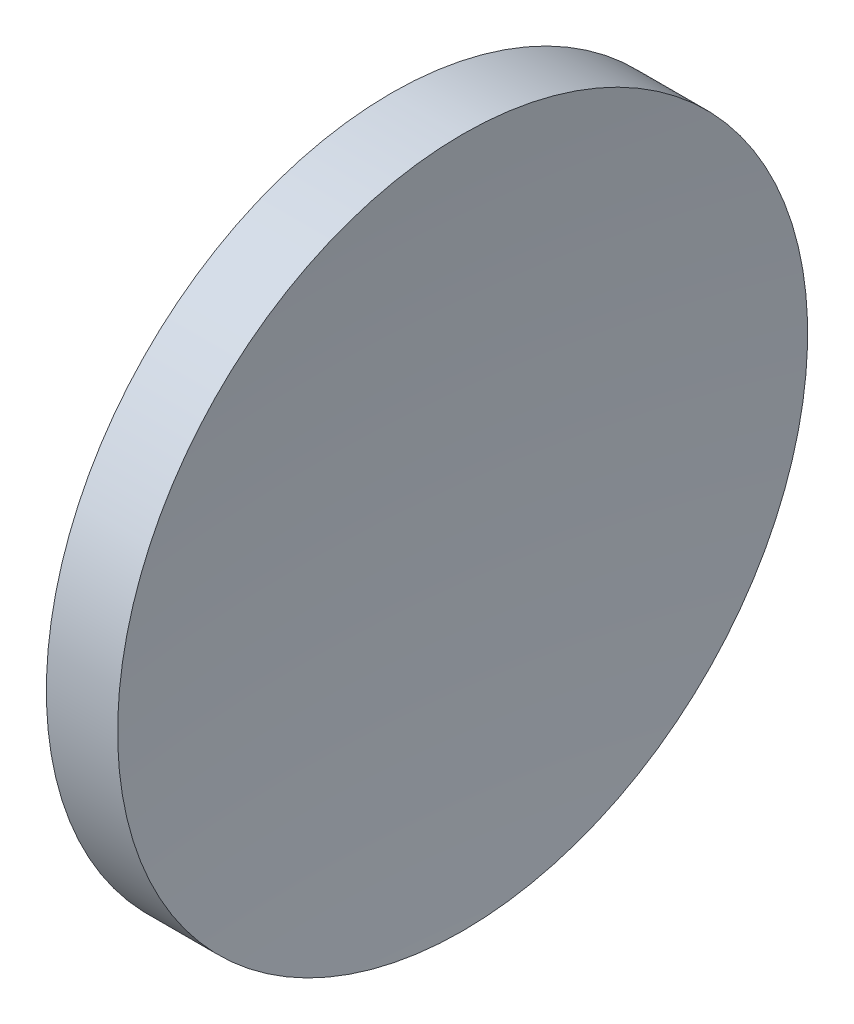
ISO-10303-21;
HEADER;
FILE_DESCRIPTION(('STEP AP214'),'2;1');
FILE_NAME('part.step','',(''),(''),'','','');
FILE_SCHEMA(('AUTOMOTIVE_DESIGN { 1 0 10303 214 1 1 1 1 }'));
ENDSEC;
DATA;
#1=APPLICATION_CONTEXT('core data for automotive mechanical design processes');
#2=APPLICATION_PROTOCOL_DEFINITION('international standard','automotive_design',2000,#1);
#3=PRODUCT_CONTEXT('',#1,'mechanical');
#4=PRODUCT('Part','Part','',(#3));
#5=PRODUCT_RELATED_PRODUCT_CATEGORY('part','',(#4));
#6=PRODUCT_DEFINITION_FORMATION('','',#4);
#7=PRODUCT_DEFINITION_CONTEXT('part definition',#1,'design');
#8=PRODUCT_DEFINITION('design','',#6,#7);
#9=PRODUCT_DEFINITION_SHAPE('','',#8);
#10=(LENGTH_UNIT() NAMED_UNIT(*) SI_UNIT(.MILLI.,.METRE.));
#11=(NAMED_UNIT(*) PLANE_ANGLE_UNIT() SI_UNIT($,.RADIAN.));
#12=(NAMED_UNIT(*) SI_UNIT($,.STERADIAN.) SOLID_ANGLE_UNIT());
#13=UNCERTAINTY_MEASURE_WITH_UNIT(LENGTH_MEASURE(1.E-05),#10,'distance_accuracy_value','');
#14=(GEOMETRIC_REPRESENTATION_CONTEXT(3) GLOBAL_UNCERTAINTY_ASSIGNED_CONTEXT((#13)) GLOBAL_UNIT_ASSIGNED_CONTEXT((#10,
#11,#12)) REPRESENTATION_CONTEXT('',''));
#15=CARTESIAN_POINT('',(0.,0.,0.));
#16=DIRECTION('',(0.,0.,1.));
#17=DIRECTION('',(1.,0.,0.));
#18=AXIS2_PLACEMENT_3D('',#15,#16,#17);
#19=CARTESIAN_POINT('',(167.612193698495,65.2168404709403,0.));
#20=DIRECTION('',(-1.,0.,0.));
#21=DIRECTION('',(0.,1.,0.));
#22=AXIS2_PLACEMENT_3D('',#19,#20,#21);
#23=SPHERICAL_SURFACE('',#22,45.);
#24=CARTESIAN_POINT('',(124.383152534018,65.2168404709403,0.));
#25=DIRECTION('',(-1.,0.,0.));
#26=DIRECTION('',(0.,-1.,0.));
#27=AXIS2_PLACEMENT_3D('',#24,#25,#26);
#28=CIRCLE('',#27,12.5);
#29=CARTESIAN_POINT('',(124.383152534018,52.7168404709403,0.));
#30=VERTEX_POINT('',#29);
#31=EDGE_CURVE('E41',#30,#30,#28,.T.);
#32=ORIENTED_EDGE('',*,*,#31,.T.);
#33=EDGE_LOOP('',(#32));
#34=FACE_BOUND('',#33,.T.);
#35=ADVANCED_FACE('F35',(#34),#23,.T.);
#36=CARTESIAN_POINT('',(246.312193698495,65.2168404709403,0.));
#37=DIRECTION('',(-1.,0.,0.));
#38=DIRECTION('',(0.,1.,0.));
#39=AXIS2_PLACEMENT_3D('',#36,#37,#38);
#40=SPHERICAL_SURFACE('',#39,120.);
#41=CARTESIAN_POINT('',(126.965011075695,65.2168404709403,0.));
#42=DIRECTION('',(-1.,0.,0.));
#43=DIRECTION('',(0.,-1.,0.));
#44=AXIS2_PLACEMENT_3D('',#41,#42,#43);
#45=CIRCLE('',#44,12.5);
#46=CARTESIAN_POINT('',(126.965011075695,52.7168404709403,0.));
#47=VERTEX_POINT('',#46);
#48=EDGE_CURVE('E10',#47,#47,#45,.T.);
#49=ORIENTED_EDGE('',*,*,#48,.F.);
#50=EDGE_LOOP('',(#49));
#51=FACE_BOUND('',#50,.T.);
#52=ADVANCED_FACE('F50',(#51),#40,.F.);
#53=CARTESIAN_POINT('',(115.944491297963,65.2168404709403,0.));
#54=DIRECTION('',(-1.,0.,0.));
#55=DIRECTION('',(0.,-1.,0.));
#56=AXIS2_PLACEMENT_3D('',#53,#54,#55);
#57=CYLINDRICAL_SURFACE('',#56,12.5);
#58=ORIENTED_EDGE('',*,*,#31,.F.);
#59=EDGE_LOOP('',(#58));
#60=FACE_BOUND('',#59,.T.);
#61=ORIENTED_EDGE('',*,*,#48,.T.);
#62=EDGE_LOOP('',(#61));
#63=FACE_BOUND('',#62,.T.);
#64=ADVANCED_FACE('F48',(#60,#63),#57,.T.);
#65=CLOSED_SHELL('',(#35,#52,#64));
#66=MANIFOLD_SOLID_BREP('B2',#65);
#67=ADVANCED_BREP_SHAPE_REPRESENTATION('',(#18,#66),#14);
#68=SHAPE_DEFINITION_REPRESENTATION(#9,#67);
ENDSEC;
END-ISO-10303-21;
